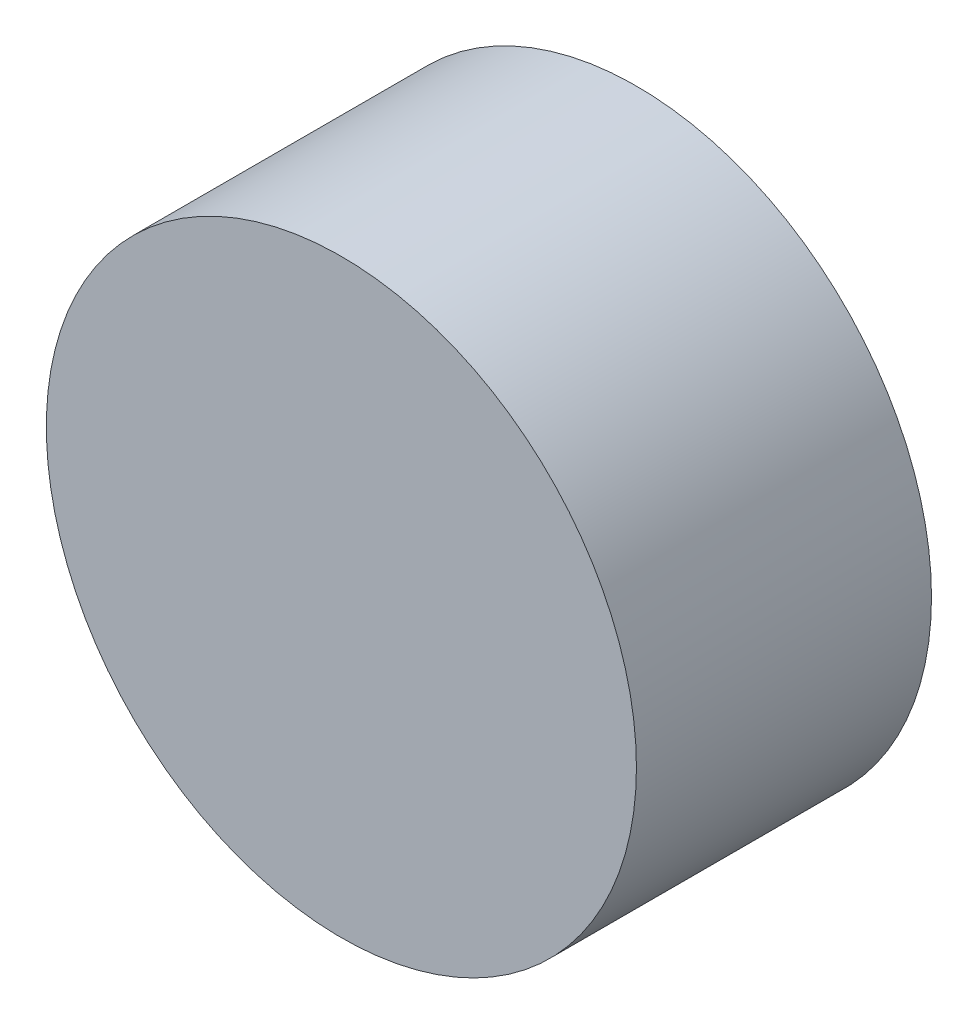
ISO-10303-21;
HEADER;
FILE_DESCRIPTION(('STEP AP214'),'2;1');
FILE_NAME('part.step','',(''),(''),'','','');
FILE_SCHEMA(('AUTOMOTIVE_DESIGN { 1 0 10303 214 1 1 1 1 }'));
ENDSEC;
DATA;
#1=APPLICATION_CONTEXT('core data for automotive mechanical design processes');
#2=APPLICATION_PROTOCOL_DEFINITION('international standard','automotive_design',2000,#1);
#3=PRODUCT_CONTEXT('',#1,'mechanical');
#4=PRODUCT('Part','Part','',(#3));
#5=PRODUCT_RELATED_PRODUCT_CATEGORY('part','',(#4));
#6=PRODUCT_DEFINITION_FORMATION('','',#4);
#7=PRODUCT_DEFINITION_CONTEXT('part definition',#1,'design');
#8=PRODUCT_DEFINITION('design','',#6,#7);
#9=PRODUCT_DEFINITION_SHAPE('','',#8);
#10=(LENGTH_UNIT() NAMED_UNIT(*) SI_UNIT(.MILLI.,.METRE.));
#11=(NAMED_UNIT(*) PLANE_ANGLE_UNIT() SI_UNIT($,.RADIAN.));
#12=(NAMED_UNIT(*) SI_UNIT($,.STERADIAN.) SOLID_ANGLE_UNIT());
#13=UNCERTAINTY_MEASURE_WITH_UNIT(LENGTH_MEASURE(1.E-05),#10,'distance_accuracy_value','');
#14=(GEOMETRIC_REPRESENTATION_CONTEXT(3) GLOBAL_UNCERTAINTY_ASSIGNED_CONTEXT((#13)) GLOBAL_UNIT_ASSIGNED_CONTEXT((#10,
#11,#12)) REPRESENTATION_CONTEXT('',''));
#15=CARTESIAN_POINT('',(0.,0.,0.));
#16=DIRECTION('',(0.,0.,1.));
#17=DIRECTION('',(1.,0.,0.));
#18=AXIS2_PLACEMENT_3D('',#15,#16,#17);
#19=CARTESIAN_POINT('',(0.,0.,3.175));
#20=DIRECTION('',(0.,0.,-1.));
#21=DIRECTION('',(-1.,0.,0.));
#22=AXIS2_PLACEMENT_3D('',#19,#20,#21);
#23=CYLINDRICAL_SURFACE('',#22,3.175);
#24=CARTESIAN_POINT('',(0.,0.,3.175));
#25=DIRECTION('',(0.,0.,1.));
#26=DIRECTION('',(1.,0.,0.));
#27=AXIS2_PLACEMENT_3D('',#24,#25,#26);
#28=CIRCLE('',#27,3.175);
#29=CARTESIAN_POINT('',(3.175,0.,3.175));
#30=VERTEX_POINT('',#29);
#31=EDGE_CURVE('E10',#30,#30,#28,.T.);
#32=ORIENTED_EDGE('',*,*,#31,.F.);
#33=EDGE_LOOP('',(#32));
#34=FACE_BOUND('',#33,.T.);
#35=CARTESIAN_POINT('',(0.,0.,0.));
#36=DIRECTION('',(0.,0.,1.));
#37=DIRECTION('',(1.,0.,0.));
#38=AXIS2_PLACEMENT_3D('',#35,#36,#37);
#39=CIRCLE('',#38,3.175);
#40=CARTESIAN_POINT('',(3.175,0.,0.));
#41=VERTEX_POINT('',#40);
#42=EDGE_CURVE('E34',#41,#41,#39,.T.);
#43=ORIENTED_EDGE('',*,*,#42,.T.);
#44=EDGE_LOOP('',(#43));
#45=FACE_BOUND('',#44,.T.);
#46=ADVANCED_FACE('F31',(#34,#45),#23,.T.);
#47=CARTESIAN_POINT('',(0.,0.,3.175));
#48=DIRECTION('',(0.,0.,1.));
#49=DIRECTION('',(1.,0.,0.));
#50=AXIS2_PLACEMENT_3D('',#47,#48,#49);
#51=PLANE('',#50);
#52=ORIENTED_EDGE('',*,*,#31,.T.);
#53=EDGE_LOOP('',(#52));
#54=FACE_BOUND('',#53,.T.);
#55=ADVANCED_FACE('F46',(#54),#51,.T.);
#56=CARTESIAN_POINT('',(0.,0.,0.));
#57=DIRECTION('',(0.,0.,1.));
#58=DIRECTION('',(1.,0.,0.));
#59=AXIS2_PLACEMENT_3D('',#56,#57,#58);
#60=PLANE('',#59);
#61=ORIENTED_EDGE('',*,*,#42,.F.);
#62=EDGE_LOOP('',(#61));
#63=FACE_BOUND('',#62,.T.);
#64=ADVANCED_FACE('F44',(#63),#60,.F.);
#65=CLOSED_SHELL('',(#46,#55,#64));
#66=MANIFOLD_SOLID_BREP('B2',#65);
#67=ADVANCED_BREP_SHAPE_REPRESENTATION('',(#18,#66),#14);
#68=SHAPE_DEFINITION_REPRESENTATION(#9,#67);
ENDSEC;
END-ISO-10303-21;
